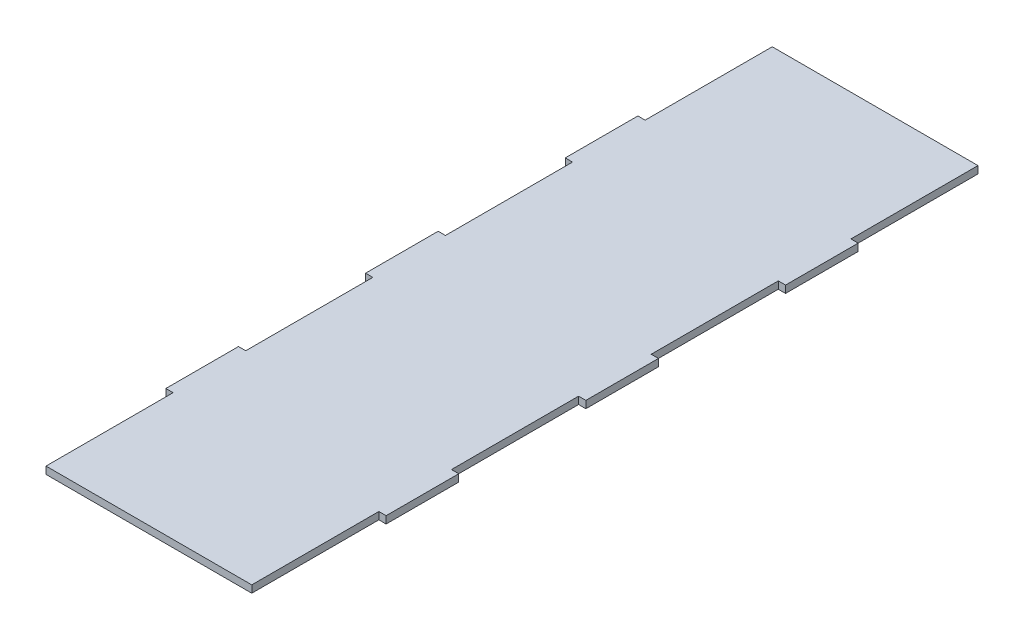
ISO-10303-21;
HEADER;
FILE_DESCRIPTION(('STEP AP214'),'2;1');
FILE_NAME('part.step','',(''),(''),'','','');
FILE_SCHEMA(('AUTOMOTIVE_DESIGN { 1 0 10303 214 1 1 1 1 }'));
ENDSEC;
DATA;
#1=APPLICATION_CONTEXT('core data for automotive mechanical design processes');
#2=APPLICATION_PROTOCOL_DEFINITION('international standard','automotive_design',2000,#1);
#3=PRODUCT_CONTEXT('',#1,'mechanical');
#4=PRODUCT('Part','Part','',(#3));
#5=PRODUCT_RELATED_PRODUCT_CATEGORY('part','',(#4));
#6=PRODUCT_DEFINITION_FORMATION('','',#4);
#7=PRODUCT_DEFINITION_CONTEXT('part definition',#1,'design');
#8=PRODUCT_DEFINITION('design','',#6,#7);
#9=PRODUCT_DEFINITION_SHAPE('','',#8);
#10=(LENGTH_UNIT() NAMED_UNIT(*) SI_UNIT(.MILLI.,.METRE.));
#11=(NAMED_UNIT(*) PLANE_ANGLE_UNIT() SI_UNIT($,.RADIAN.));
#12=(NAMED_UNIT(*) SI_UNIT($,.STERADIAN.) SOLID_ANGLE_UNIT());
#13=UNCERTAINTY_MEASURE_WITH_UNIT(LENGTH_MEASURE(1.E-05),#10,'distance_accuracy_value','');
#14=(GEOMETRIC_REPRESENTATION_CONTEXT(3) GLOBAL_UNCERTAINTY_ASSIGNED_CONTEXT((#13)) GLOBAL_UNIT_ASSIGNED_CONTEXT((#10,
#11,#12)) REPRESENTATION_CONTEXT('',''));
#15=CARTESIAN_POINT('',(0.,0.,0.));
#16=DIRECTION('',(0.,0.,1.));
#17=DIRECTION('',(1.,0.,0.));
#18=AXIS2_PLACEMENT_3D('',#15,#16,#17);
#19=CARTESIAN_POINT('',(-42.5,3.,-97.5));
#20=DIRECTION('',(1.,0.,0.));
#21=DIRECTION('',(0.,0.,-1.));
#22=AXIS2_PLACEMENT_3D('',#19,#20,#21);
#23=PLANE('',#22);
#24=DIRECTION('',(0.,0.,1.));
#25=VECTOR('',#24,1.);
#26=CARTESIAN_POINT('',(-42.5,0.,-97.5));
#27=LINE('',#26,#25);
#28=CARTESIAN_POINT('',(-42.5,0.,-150.));
#29=VERTEX_POINT('',#28);
#30=CARTESIAN_POINT('',(-42.5,0.,-97.5));
#31=VERTEX_POINT('',#30);
#32=EDGE_CURVE('E254',#29,#31,#27,.T.);
#33=ORIENTED_EDGE('',*,*,#32,.T.);
#34=DIRECTION('',(0.,-1.,0.));
#35=VECTOR('',#34,1.);
#36=CARTESIAN_POINT('',(-42.5,3.,-97.5));
#37=LINE('',#36,#35);
#38=CARTESIAN_POINT('',(-42.5,3.,-97.5));
#39=VERTEX_POINT('',#38);
#40=EDGE_CURVE('E11',#39,#31,#37,.T.);
#41=ORIENTED_EDGE('',*,*,#40,.F.);
#42=DIRECTION('',(0.,0.,1.));
#43=VECTOR('',#42,1.);
#44=CARTESIAN_POINT('',(-42.5,3.,-97.5));
#45=LINE('',#44,#43);
#46=CARTESIAN_POINT('',(-42.5,3.,-150.));
#47=VERTEX_POINT('',#46);
#48=EDGE_CURVE('E308',#47,#39,#45,.T.);
#49=ORIENTED_EDGE('',*,*,#48,.F.);
#50=DIRECTION('',(0.,-1.,0.));
#51=VECTOR('',#50,1.);
#52=CARTESIAN_POINT('',(-42.5,3.,-150.));
#53=LINE('',#52,#51);
#54=EDGE_CURVE('E250',#47,#29,#53,.T.);
#55=ORIENTED_EDGE('',*,*,#54,.T.);
#56=EDGE_LOOP('',(#33,#41,#49,#55));
#57=FACE_BOUND('',#56,.T.);
#58=ADVANCED_FACE('F38',(#57),#23,.F.);
#59=CARTESIAN_POINT('',(-45.5,3.,-97.5));
#60=DIRECTION('',(0.,0.,1.));
#61=DIRECTION('',(1.,0.,0.));
#62=AXIS2_PLACEMENT_3D('',#59,#60,#61);
#63=PLANE('',#62);
#64=DIRECTION('',(-1.,0.,0.));
#65=VECTOR('',#64,1.);
#66=CARTESIAN_POINT('',(-45.5,0.,-97.5));
#67=LINE('',#66,#65);
#68=CARTESIAN_POINT('',(-45.5,0.,-97.5));
#69=VERTEX_POINT('',#68);
#70=EDGE_CURVE('E257',#31,#69,#67,.T.);
#71=ORIENTED_EDGE('',*,*,#70,.T.);
#72=DIRECTION('',(0.,-1.,0.));
#73=VECTOR('',#72,1.);
#74=CARTESIAN_POINT('',(-45.5,3.,-97.5));
#75=LINE('',#74,#73);
#76=CARTESIAN_POINT('',(-45.5,3.,-97.5));
#77=VERTEX_POINT('',#76);
#78=EDGE_CURVE('E46',#77,#69,#75,.T.);
#79=ORIENTED_EDGE('',*,*,#78,.F.);
#80=DIRECTION('',(-1.,0.,0.));
#81=VECTOR('',#80,1.);
#82=CARTESIAN_POINT('',(-45.5,3.,-97.5));
#83=LINE('',#82,#81);
#84=EDGE_CURVE('E157',#39,#77,#83,.T.);
#85=ORIENTED_EDGE('',*,*,#84,.F.);
#86=ORIENTED_EDGE('',*,*,#40,.T.);
#87=EDGE_LOOP('',(#71,#79,#85,#86));
#88=FACE_BOUND('',#87,.T.);
#89=ADVANCED_FACE('F466',(#88),#63,.F.);
#90=CARTESIAN_POINT('',(-45.5,3.,-67.5));
#91=DIRECTION('',(1.,0.,0.));
#92=DIRECTION('',(0.,0.,-1.));
#93=AXIS2_PLACEMENT_3D('',#90,#91,#92);
#94=PLANE('',#93);
#95=DIRECTION('',(0.,0.,1.));
#96=VECTOR('',#95,1.);
#97=CARTESIAN_POINT('',(-45.5,0.,-67.5));
#98=LINE('',#97,#96);
#99=CARTESIAN_POINT('',(-45.5,0.,-67.5));
#100=VERTEX_POINT('',#99);
#101=EDGE_CURVE('E259',#69,#100,#98,.T.);
#102=ORIENTED_EDGE('',*,*,#101,.T.);
#103=DIRECTION('',(0.,-1.,0.));
#104=VECTOR('',#103,1.);
#105=CARTESIAN_POINT('',(-45.5,3.,-67.5));
#106=LINE('',#105,#104);
#107=CARTESIAN_POINT('',(-45.5,3.,-67.5));
#108=VERTEX_POINT('',#107);
#109=EDGE_CURVE('E375',#108,#100,#106,.T.);
#110=ORIENTED_EDGE('',*,*,#109,.F.);
#111=DIRECTION('',(0.,0.,1.));
#112=VECTOR('',#111,1.);
#113=CARTESIAN_POINT('',(-45.5,3.,-67.5));
#114=LINE('',#113,#112);
#115=EDGE_CURVE('E383',#77,#108,#114,.T.);
#116=ORIENTED_EDGE('',*,*,#115,.F.);
#117=ORIENTED_EDGE('',*,*,#78,.T.);
#118=EDGE_LOOP('',(#102,#110,#116,#117));
#119=FACE_BOUND('',#118,.T.);
#120=ADVANCED_FACE('F381',(#119),#94,.F.);
#121=CARTESIAN_POINT('',(-45.5,3.,-67.5));
#122=DIRECTION('',(0.,0.,-1.));
#123=DIRECTION('',(-1.,0.,0.));
#124=AXIS2_PLACEMENT_3D('',#121,#122,#123);
#125=PLANE('',#124);
#126=DIRECTION('',(1.,0.,0.));
#127=VECTOR('',#126,1.);
#128=CARTESIAN_POINT('',(-45.5,0.,-67.5));
#129=LINE('',#128,#127);
#130=CARTESIAN_POINT('',(-42.5,0.,-67.5));
#131=VERTEX_POINT('',#130);
#132=EDGE_CURVE('E261',#100,#131,#129,.T.);
#133=ORIENTED_EDGE('',*,*,#132,.T.);
#134=DIRECTION('',(0.,-1.,0.));
#135=VECTOR('',#134,1.);
#136=CARTESIAN_POINT('',(-42.5,3.,-67.5));
#137=LINE('',#136,#135);
#138=CARTESIAN_POINT('',(-42.5,3.,-67.5));
#139=VERTEX_POINT('',#138);
#140=EDGE_CURVE('E372',#139,#131,#137,.T.);
#141=ORIENTED_EDGE('',*,*,#140,.F.);
#142=DIRECTION('',(1.,0.,0.));
#143=VECTOR('',#142,1.);
#144=CARTESIAN_POINT('',(-45.5,3.,-67.5));
#145=LINE('',#144,#143);
#146=EDGE_CURVE('E401',#108,#139,#145,.T.);
#147=ORIENTED_EDGE('',*,*,#146,.F.);
#148=ORIENTED_EDGE('',*,*,#109,.T.);
#149=EDGE_LOOP('',(#133,#141,#147,#148));
#150=FACE_BOUND('',#149,.T.);
#151=ADVANCED_FACE('F392',(#150),#125,.F.);
#152=CARTESIAN_POINT('',(-42.5,3.,-15.));
#153=DIRECTION('',(1.,0.,0.));
#154=DIRECTION('',(0.,0.,-1.));
#155=AXIS2_PLACEMENT_3D('',#152,#153,#154);
#156=PLANE('',#155);
#157=DIRECTION('',(0.,0.,1.));
#158=VECTOR('',#157,1.);
#159=CARTESIAN_POINT('',(-42.5,0.,-15.));
#160=LINE('',#159,#158);
#161=CARTESIAN_POINT('',(-42.5,0.,-15.));
#162=VERTEX_POINT('',#161);
#163=EDGE_CURVE('E263',#131,#162,#160,.T.);
#164=ORIENTED_EDGE('',*,*,#163,.T.);
#165=DIRECTION('',(0.,-1.,0.));
#166=VECTOR('',#165,1.);
#167=CARTESIAN_POINT('',(-42.5,3.,-15.));
#168=LINE('',#167,#166);
#169=CARTESIAN_POINT('',(-42.5,3.,-15.));
#170=VERTEX_POINT('',#169);
#171=EDGE_CURVE('E369',#170,#162,#168,.T.);
#172=ORIENTED_EDGE('',*,*,#171,.F.);
#173=DIRECTION('',(0.,0.,1.));
#174=VECTOR('',#173,1.);
#175=CARTESIAN_POINT('',(-42.5,3.,-15.));
#176=LINE('',#175,#174);
#177=EDGE_CURVE('E398',#139,#170,#176,.T.);
#178=ORIENTED_EDGE('',*,*,#177,.F.);
#179=ORIENTED_EDGE('',*,*,#140,.T.);
#180=EDGE_LOOP('',(#164,#172,#178,#179));
#181=FACE_BOUND('',#180,.T.);
#182=ADVANCED_FACE('F396',(#181),#156,.F.);
#183=CARTESIAN_POINT('',(-45.5,3.,-15.));
#184=DIRECTION('',(0.,0.,1.));
#185=DIRECTION('',(1.,0.,0.));
#186=AXIS2_PLACEMENT_3D('',#183,#184,#185);
#187=PLANE('',#186);
#188=DIRECTION('',(-1.,0.,0.));
#189=VECTOR('',#188,1.);
#190=CARTESIAN_POINT('',(-45.5,0.,-15.));
#191=LINE('',#190,#189);
#192=CARTESIAN_POINT('',(-45.5,0.,-15.));
#193=VERTEX_POINT('',#192);
#194=EDGE_CURVE('E265',#162,#193,#191,.T.);
#195=ORIENTED_EDGE('',*,*,#194,.T.);
#196=DIRECTION('',(0.,-1.,0.));
#197=VECTOR('',#196,1.);
#198=CARTESIAN_POINT('',(-45.5,3.,-15.));
#199=LINE('',#198,#197);
#200=CARTESIAN_POINT('',(-45.5,3.,-15.));
#201=VERTEX_POINT('',#200);
#202=EDGE_CURVE('E366',#201,#193,#199,.T.);
#203=ORIENTED_EDGE('',*,*,#202,.F.);
#204=DIRECTION('',(-1.,0.,0.));
#205=VECTOR('',#204,1.);
#206=CARTESIAN_POINT('',(-45.5,3.,-15.));
#207=LINE('',#206,#205);
#208=EDGE_CURVE('E400',#170,#201,#207,.T.);
#209=ORIENTED_EDGE('',*,*,#208,.F.);
#210=ORIENTED_EDGE('',*,*,#171,.T.);
#211=EDGE_LOOP('',(#195,#203,#209,#210));
#212=FACE_BOUND('',#211,.T.);
#213=ADVANCED_FACE('F479',(#212),#187,.F.);
#214=CARTESIAN_POINT('',(-45.5,3.,15.));
#215=DIRECTION('',(1.,0.,0.));
#216=DIRECTION('',(0.,0.,-1.));
#217=AXIS2_PLACEMENT_3D('',#214,#215,#216);
#218=PLANE('',#217);
#219=DIRECTION('',(0.,0.,1.));
#220=VECTOR('',#219,1.);
#221=CARTESIAN_POINT('',(-45.5,0.,15.));
#222=LINE('',#221,#220);
#223=CARTESIAN_POINT('',(-45.5,0.,15.));
#224=VERTEX_POINT('',#223);
#225=EDGE_CURVE('E267',#193,#224,#222,.T.);
#226=ORIENTED_EDGE('',*,*,#225,.T.);
#227=DIRECTION('',(0.,-1.,0.));
#228=VECTOR('',#227,1.);
#229=CARTESIAN_POINT('',(-45.5,3.,15.));
#230=LINE('',#229,#228);
#231=CARTESIAN_POINT('',(-45.5,3.,15.));
#232=VERTEX_POINT('',#231);
#233=EDGE_CURVE('E363',#232,#224,#230,.T.);
#234=ORIENTED_EDGE('',*,*,#233,.F.);
#235=DIRECTION('',(0.,0.,1.));
#236=VECTOR('',#235,1.);
#237=CARTESIAN_POINT('',(-45.5,3.,15.));
#238=LINE('',#237,#236);
#239=EDGE_CURVE('E403',#201,#232,#238,.T.);
#240=ORIENTED_EDGE('',*,*,#239,.F.);
#241=ORIENTED_EDGE('',*,*,#202,.T.);
#242=EDGE_LOOP('',(#226,#234,#240,#241));
#243=FACE_BOUND('',#242,.T.);
#244=ADVANCED_FACE('F482',(#243),#218,.F.);
#245=CARTESIAN_POINT('',(-45.5,3.,15.));
#246=DIRECTION('',(0.,0.,-1.));
#247=DIRECTION('',(-1.,0.,0.));
#248=AXIS2_PLACEMENT_3D('',#245,#246,#247);
#249=PLANE('',#248);
#250=DIRECTION('',(1.,0.,0.));
#251=VECTOR('',#250,1.);
#252=CARTESIAN_POINT('',(-45.5,0.,15.));
#253=LINE('',#252,#251);
#254=CARTESIAN_POINT('',(-42.5,0.,15.));
#255=VERTEX_POINT('',#254);
#256=EDGE_CURVE('E269',#224,#255,#253,.T.);
#257=ORIENTED_EDGE('',*,*,#256,.T.);
#258=DIRECTION('',(0.,-1.,0.));
#259=VECTOR('',#258,1.);
#260=CARTESIAN_POINT('',(-42.5,3.,15.));
#261=LINE('',#260,#259);
#262=CARTESIAN_POINT('',(-42.5,3.,15.));
#263=VERTEX_POINT('',#262);
#264=EDGE_CURVE('E360',#263,#255,#261,.T.);
#265=ORIENTED_EDGE('',*,*,#264,.F.);
#266=DIRECTION('',(1.,0.,0.));
#267=VECTOR('',#266,1.);
#268=CARTESIAN_POINT('',(-45.5,3.,15.));
#269=LINE('',#268,#267);
#270=EDGE_CURVE('E409',#232,#263,#269,.T.);
#271=ORIENTED_EDGE('',*,*,#270,.F.);
#272=ORIENTED_EDGE('',*,*,#233,.T.);
#273=EDGE_LOOP('',(#257,#265,#271,#272));
#274=FACE_BOUND('',#273,.T.);
#275=ADVANCED_FACE('F486',(#274),#249,.F.);
#276=CARTESIAN_POINT('',(-42.5,3.,67.5));
#277=DIRECTION('',(1.,0.,0.));
#278=DIRECTION('',(0.,0.,-1.));
#279=AXIS2_PLACEMENT_3D('',#276,#277,#278);
#280=PLANE('',#279);
#281=DIRECTION('',(0.,0.,1.));
#282=VECTOR('',#281,1.);
#283=CARTESIAN_POINT('',(-42.5,0.,67.5));
#284=LINE('',#283,#282);
#285=CARTESIAN_POINT('',(-42.5,0.,67.5));
#286=VERTEX_POINT('',#285);
#287=EDGE_CURVE('E271',#255,#286,#284,.T.);
#288=ORIENTED_EDGE('',*,*,#287,.T.);
#289=DIRECTION('',(0.,-1.,0.));
#290=VECTOR('',#289,1.);
#291=CARTESIAN_POINT('',(-42.5,3.,67.5));
#292=LINE('',#291,#290);
#293=CARTESIAN_POINT('',(-42.5,3.,67.5));
#294=VERTEX_POINT('',#293);
#295=EDGE_CURVE('E357',#294,#286,#292,.T.);
#296=ORIENTED_EDGE('',*,*,#295,.F.);
#297=DIRECTION('',(0.,0.,1.));
#298=VECTOR('',#297,1.);
#299=CARTESIAN_POINT('',(-42.5,3.,67.5));
#300=LINE('',#299,#298);
#301=EDGE_CURVE('E411',#263,#294,#300,.T.);
#302=ORIENTED_EDGE('',*,*,#301,.F.);
#303=ORIENTED_EDGE('',*,*,#264,.T.);
#304=EDGE_LOOP('',(#288,#296,#302,#303));
#305=FACE_BOUND('',#304,.T.);
#306=ADVANCED_FACE('F490',(#305),#280,.F.);
#307=CARTESIAN_POINT('',(-45.5,3.,67.5));
#308=DIRECTION('',(0.,0.,1.));
#309=DIRECTION('',(1.,0.,0.));
#310=AXIS2_PLACEMENT_3D('',#307,#308,#309);
#311=PLANE('',#310);
#312=DIRECTION('',(-1.,0.,0.));
#313=VECTOR('',#312,1.);
#314=CARTESIAN_POINT('',(-45.5,0.,67.5));
#315=LINE('',#314,#313);
#316=CARTESIAN_POINT('',(-45.5,0.,67.5));
#317=VERTEX_POINT('',#316);
#318=EDGE_CURVE('E273',#286,#317,#315,.T.);
#319=ORIENTED_EDGE('',*,*,#318,.T.);
#320=DIRECTION('',(0.,-1.,0.));
#321=VECTOR('',#320,1.);
#322=CARTESIAN_POINT('',(-45.5,3.,67.5));
#323=LINE('',#322,#321);
#324=CARTESIAN_POINT('',(-45.5,3.,67.5));
#325=VERTEX_POINT('',#324);
#326=EDGE_CURVE('E354',#325,#317,#323,.T.);
#327=ORIENTED_EDGE('',*,*,#326,.F.);
#328=DIRECTION('',(-1.,0.,0.));
#329=VECTOR('',#328,1.);
#330=CARTESIAN_POINT('',(-45.5,3.,67.5));
#331=LINE('',#330,#329);
#332=EDGE_CURVE('E413',#294,#325,#331,.T.);
#333=ORIENTED_EDGE('',*,*,#332,.F.);
#334=ORIENTED_EDGE('',*,*,#295,.T.);
#335=EDGE_LOOP('',(#319,#327,#333,#334));
#336=FACE_BOUND('',#335,.T.);
#337=ADVANCED_FACE('F494',(#336),#311,.F.);
#338=CARTESIAN_POINT('',(-45.5,3.,97.5));
#339=DIRECTION('',(1.,0.,0.));
#340=DIRECTION('',(0.,0.,-1.));
#341=AXIS2_PLACEMENT_3D('',#338,#339,#340);
#342=PLANE('',#341);
#343=DIRECTION('',(0.,0.,1.));
#344=VECTOR('',#343,1.);
#345=CARTESIAN_POINT('',(-45.5,0.,97.5));
#346=LINE('',#345,#344);
#347=CARTESIAN_POINT('',(-45.5,0.,97.5));
#348=VERTEX_POINT('',#347);
#349=EDGE_CURVE('E275',#317,#348,#346,.T.);
#350=ORIENTED_EDGE('',*,*,#349,.T.);
#351=DIRECTION('',(0.,-1.,0.));
#352=VECTOR('',#351,1.);
#353=CARTESIAN_POINT('',(-45.5,3.,97.5));
#354=LINE('',#353,#352);
#355=CARTESIAN_POINT('',(-45.5,3.,97.5));
#356=VERTEX_POINT('',#355);
#357=EDGE_CURVE('E351',#356,#348,#354,.T.);
#358=ORIENTED_EDGE('',*,*,#357,.F.);
#359=DIRECTION('',(0.,0.,1.));
#360=VECTOR('',#359,1.);
#361=CARTESIAN_POINT('',(-45.5,3.,97.5));
#362=LINE('',#361,#360);
#363=EDGE_CURVE('E415',#325,#356,#362,.T.);
#364=ORIENTED_EDGE('',*,*,#363,.F.);
#365=ORIENTED_EDGE('',*,*,#326,.T.);
#366=EDGE_LOOP('',(#350,#358,#364,#365));
#367=FACE_BOUND('',#366,.T.);
#368=ADVANCED_FACE('F498',(#367),#342,.F.);
#369=CARTESIAN_POINT('',(-45.5,3.,97.5));
#370=DIRECTION('',(0.,0.,-1.));
#371=DIRECTION('',(-1.,0.,0.));
#372=AXIS2_PLACEMENT_3D('',#369,#370,#371);
#373=PLANE('',#372);
#374=DIRECTION('',(1.,0.,0.));
#375=VECTOR('',#374,1.);
#376=CARTESIAN_POINT('',(-45.5,0.,97.5));
#377=LINE('',#376,#375);
#378=CARTESIAN_POINT('',(-42.5,0.,97.5));
#379=VERTEX_POINT('',#378);
#380=EDGE_CURVE('E277',#348,#379,#377,.T.);
#381=ORIENTED_EDGE('',*,*,#380,.T.);
#382=DIRECTION('',(0.,-1.,0.));
#383=VECTOR('',#382,1.);
#384=CARTESIAN_POINT('',(-42.5,3.,97.5));
#385=LINE('',#384,#383);
#386=CARTESIAN_POINT('',(-42.5,3.,97.5));
#387=VERTEX_POINT('',#386);
#388=EDGE_CURVE('E348',#387,#379,#385,.T.);
#389=ORIENTED_EDGE('',*,*,#388,.F.);
#390=DIRECTION('',(1.,0.,0.));
#391=VECTOR('',#390,1.);
#392=CARTESIAN_POINT('',(-45.5,3.,97.5));
#393=LINE('',#392,#391);
#394=EDGE_CURVE('E417',#356,#387,#393,.T.);
#395=ORIENTED_EDGE('',*,*,#394,.F.);
#396=ORIENTED_EDGE('',*,*,#357,.T.);
#397=EDGE_LOOP('',(#381,#389,#395,#396));
#398=FACE_BOUND('',#397,.T.);
#399=ADVANCED_FACE('F502',(#398),#373,.F.);
#400=CARTESIAN_POINT('',(-42.5,3.,150.));
#401=DIRECTION('',(1.,0.,0.));
#402=DIRECTION('',(0.,0.,-1.));
#403=AXIS2_PLACEMENT_3D('',#400,#401,#402);
#404=PLANE('',#403);
#405=DIRECTION('',(0.,0.,1.));
#406=VECTOR('',#405,1.);
#407=CARTESIAN_POINT('',(-42.5,0.,150.));
#408=LINE('',#407,#406);
#409=CARTESIAN_POINT('',(-42.5,0.,150.));
#410=VERTEX_POINT('',#409);
#411=EDGE_CURVE('E279',#379,#410,#408,.T.);
#412=ORIENTED_EDGE('',*,*,#411,.T.);
#413=DIRECTION('',(0.,-1.,0.));
#414=VECTOR('',#413,1.);
#415=CARTESIAN_POINT('',(-42.5,3.,150.));
#416=LINE('',#415,#414);
#417=CARTESIAN_POINT('',(-42.5,3.,150.));
#418=VERTEX_POINT('',#417);
#419=EDGE_CURVE('E345',#418,#410,#416,.T.);
#420=ORIENTED_EDGE('',*,*,#419,.F.);
#421=DIRECTION('',(0.,0.,1.));
#422=VECTOR('',#421,1.);
#423=CARTESIAN_POINT('',(-42.5,3.,150.));
#424=LINE('',#423,#422);
#425=EDGE_CURVE('E419',#387,#418,#424,.T.);
#426=ORIENTED_EDGE('',*,*,#425,.F.);
#427=ORIENTED_EDGE('',*,*,#388,.T.);
#428=EDGE_LOOP('',(#412,#420,#426,#427));
#429=FACE_BOUND('',#428,.T.);
#430=ADVANCED_FACE('F506',(#429),#404,.F.);
#431=CARTESIAN_POINT('',(42.5,3.,150.));
#432=DIRECTION('',(0.,0.,-1.));
#433=DIRECTION('',(-1.,0.,0.));
#434=AXIS2_PLACEMENT_3D('',#431,#432,#433);
#435=PLANE('',#434);
#436=DIRECTION('',(1.,0.,0.));
#437=VECTOR('',#436,1.);
#438=CARTESIAN_POINT('',(42.5,0.,150.));
#439=LINE('',#438,#437);
#440=CARTESIAN_POINT('',(42.5,0.,150.));
#441=VERTEX_POINT('',#440);
#442=EDGE_CURVE('E281',#410,#441,#439,.T.);
#443=ORIENTED_EDGE('',*,*,#442,.T.);
#444=DIRECTION('',(0.,-1.,0.));
#445=VECTOR('',#444,1.);
#446=CARTESIAN_POINT('',(42.5,3.,150.));
#447=LINE('',#446,#445);
#448=CARTESIAN_POINT('',(42.5,3.,150.));
#449=VERTEX_POINT('',#448);
#450=EDGE_CURVE('E342',#449,#441,#447,.T.);
#451=ORIENTED_EDGE('',*,*,#450,.F.);
#452=DIRECTION('',(1.,0.,0.));
#453=VECTOR('',#452,1.);
#454=CARTESIAN_POINT('',(42.5,3.,150.));
#455=LINE('',#454,#453);
#456=EDGE_CURVE('E421',#418,#449,#455,.T.);
#457=ORIENTED_EDGE('',*,*,#456,.F.);
#458=ORIENTED_EDGE('',*,*,#419,.T.);
#459=EDGE_LOOP('',(#443,#451,#457,#458));
#460=FACE_BOUND('',#459,.T.);
#461=ADVANCED_FACE('F510',(#460),#435,.F.);
#462=CARTESIAN_POINT('',(42.5,3.,150.));
#463=DIRECTION('',(-1.,0.,0.));
#464=DIRECTION('',(0.,0.,1.));
#465=AXIS2_PLACEMENT_3D('',#462,#463,#464);
#466=PLANE('',#465);
#467=DIRECTION('',(0.,0.,-1.));
#468=VECTOR('',#467,1.);
#469=CARTESIAN_POINT('',(42.5,0.,150.));
#470=LINE('',#469,#468);
#471=CARTESIAN_POINT('',(42.5,0.,97.5));
#472=VERTEX_POINT('',#471);
#473=EDGE_CURVE('E283',#441,#472,#470,.T.);
#474=ORIENTED_EDGE('',*,*,#473,.T.);
#475=DIRECTION('',(0.,-1.,0.));
#476=VECTOR('',#475,1.);
#477=CARTESIAN_POINT('',(42.5,3.,97.5));
#478=LINE('',#477,#476);
#479=CARTESIAN_POINT('',(42.5,3.,97.5));
#480=VERTEX_POINT('',#479);
#481=EDGE_CURVE('E339',#480,#472,#478,.T.);
#482=ORIENTED_EDGE('',*,*,#481,.F.);
#483=DIRECTION('',(0.,0.,-1.));
#484=VECTOR('',#483,1.);
#485=CARTESIAN_POINT('',(42.5,3.,150.));
#486=LINE('',#485,#484);
#487=EDGE_CURVE('E423',#449,#480,#486,.T.);
#488=ORIENTED_EDGE('',*,*,#487,.F.);
#489=ORIENTED_EDGE('',*,*,#450,.T.);
#490=EDGE_LOOP('',(#474,#482,#488,#489));
#491=FACE_BOUND('',#490,.T.);
#492=ADVANCED_FACE('F514',(#491),#466,.F.);
#493=CARTESIAN_POINT('',(42.5,3.,97.5));
#494=DIRECTION('',(0.,0.,-1.));
#495=DIRECTION('',(-1.,0.,0.));
#496=AXIS2_PLACEMENT_3D('',#493,#494,#495);
#497=PLANE('',#496);
#498=DIRECTION('',(1.,0.,0.));
#499=VECTOR('',#498,1.);
#500=CARTESIAN_POINT('',(42.5,0.,97.5));
#501=LINE('',#500,#499);
#502=CARTESIAN_POINT('',(45.5,0.,97.5));
#503=VERTEX_POINT('',#502);
#504=EDGE_CURVE('E285',#472,#503,#501,.T.);
#505=ORIENTED_EDGE('',*,*,#504,.T.);
#506=DIRECTION('',(0.,-1.,0.));
#507=VECTOR('',#506,1.);
#508=CARTESIAN_POINT('',(45.5,3.,97.5));
#509=LINE('',#508,#507);
#510=CARTESIAN_POINT('',(45.5,3.,97.5));
#511=VERTEX_POINT('',#510);
#512=EDGE_CURVE('E336',#511,#503,#509,.T.);
#513=ORIENTED_EDGE('',*,*,#512,.F.);
#514=DIRECTION('',(1.,0.,0.));
#515=VECTOR('',#514,1.);
#516=CARTESIAN_POINT('',(42.5,3.,97.5));
#517=LINE('',#516,#515);
#518=EDGE_CURVE('E425',#480,#511,#517,.T.);
#519=ORIENTED_EDGE('',*,*,#518,.F.);
#520=ORIENTED_EDGE('',*,*,#481,.T.);
#521=EDGE_LOOP('',(#505,#513,#519,#520));
#522=FACE_BOUND('',#521,.T.);
#523=ADVANCED_FACE('F518',(#522),#497,.F.);
#524=CARTESIAN_POINT('',(45.5,3.,97.5));
#525=DIRECTION('',(-1.,0.,0.));
#526=DIRECTION('',(0.,0.,1.));
#527=AXIS2_PLACEMENT_3D('',#524,#525,#526);
#528=PLANE('',#527);
#529=DIRECTION('',(0.,0.,-1.));
#530=VECTOR('',#529,1.);
#531=CARTESIAN_POINT('',(45.5,0.,97.5));
#532=LINE('',#531,#530);
#533=CARTESIAN_POINT('',(45.5,0.,67.5));
#534=VERTEX_POINT('',#533);
#535=EDGE_CURVE('E287',#503,#534,#532,.T.);
#536=ORIENTED_EDGE('',*,*,#535,.T.);
#537=DIRECTION('',(0.,-1.,0.));
#538=VECTOR('',#537,1.);
#539=CARTESIAN_POINT('',(45.5,3.,67.5));
#540=LINE('',#539,#538);
#541=CARTESIAN_POINT('',(45.5,3.,67.5));
#542=VERTEX_POINT('',#541);
#543=EDGE_CURVE('E333',#542,#534,#540,.T.);
#544=ORIENTED_EDGE('',*,*,#543,.F.);
#545=DIRECTION('',(0.,0.,-1.));
#546=VECTOR('',#545,1.);
#547=CARTESIAN_POINT('',(45.5,3.,97.5));
#548=LINE('',#547,#546);
#549=EDGE_CURVE('E427',#511,#542,#548,.T.);
#550=ORIENTED_EDGE('',*,*,#549,.F.);
#551=ORIENTED_EDGE('',*,*,#512,.T.);
#552=EDGE_LOOP('',(#536,#544,#550,#551));
#553=FACE_BOUND('',#552,.T.);
#554=ADVANCED_FACE('F522',(#553),#528,.F.);
#555=CARTESIAN_POINT('',(42.5,3.,67.5));
#556=DIRECTION('',(0.,0.,1.));
#557=DIRECTION('',(1.,0.,0.));
#558=AXIS2_PLACEMENT_3D('',#555,#556,#557);
#559=PLANE('',#558);
#560=DIRECTION('',(-1.,0.,0.));
#561=VECTOR('',#560,1.);
#562=CARTESIAN_POINT('',(42.5,0.,67.5));
#563=LINE('',#562,#561);
#564=CARTESIAN_POINT('',(42.5,0.,67.5));
#565=VERTEX_POINT('',#564);
#566=EDGE_CURVE('E289',#534,#565,#563,.T.);
#567=ORIENTED_EDGE('',*,*,#566,.T.);
#568=DIRECTION('',(0.,-1.,0.));
#569=VECTOR('',#568,1.);
#570=CARTESIAN_POINT('',(42.5,3.,67.5));
#571=LINE('',#570,#569);
#572=CARTESIAN_POINT('',(42.5,3.,67.5));
#573=VERTEX_POINT('',#572);
#574=EDGE_CURVE('E330',#573,#565,#571,.T.);
#575=ORIENTED_EDGE('',*,*,#574,.F.);
#576=DIRECTION('',(-1.,0.,0.));
#577=VECTOR('',#576,1.);
#578=CARTESIAN_POINT('',(42.5,3.,67.5));
#579=LINE('',#578,#577);
#580=EDGE_CURVE('E429',#542,#573,#579,.T.);
#581=ORIENTED_EDGE('',*,*,#580,.F.);
#582=ORIENTED_EDGE('',*,*,#543,.T.);
#583=EDGE_LOOP('',(#567,#575,#581,#582));
#584=FACE_BOUND('',#583,.T.);
#585=ADVANCED_FACE('F526',(#584),#559,.F.);
#586=CARTESIAN_POINT('',(42.5,3.,67.5));
#587=DIRECTION('',(-1.,0.,0.));
#588=DIRECTION('',(0.,0.,1.));
#589=AXIS2_PLACEMENT_3D('',#586,#587,#588);
#590=PLANE('',#589);
#591=DIRECTION('',(0.,0.,-1.));
#592=VECTOR('',#591,1.);
#593=CARTESIAN_POINT('',(42.5,0.,67.5));
#594=LINE('',#593,#592);
#595=CARTESIAN_POINT('',(42.5,0.,15.));
#596=VERTEX_POINT('',#595);
#597=EDGE_CURVE('E291',#565,#596,#594,.T.);
#598=ORIENTED_EDGE('',*,*,#597,.T.);
#599=DIRECTION('',(0.,-1.,0.));
#600=VECTOR('',#599,1.);
#601=CARTESIAN_POINT('',(42.5,3.,15.));
#602=LINE('',#601,#600);
#603=CARTESIAN_POINT('',(42.5,3.,15.));
#604=VERTEX_POINT('',#603);
#605=EDGE_CURVE('E327',#604,#596,#602,.T.);
#606=ORIENTED_EDGE('',*,*,#605,.F.);
#607=DIRECTION('',(0.,0.,-1.));
#608=VECTOR('',#607,1.);
#609=CARTESIAN_POINT('',(42.5,3.,67.5));
#610=LINE('',#609,#608);
#611=EDGE_CURVE('E431',#573,#604,#610,.T.);
#612=ORIENTED_EDGE('',*,*,#611,.F.);
#613=ORIENTED_EDGE('',*,*,#574,.T.);
#614=EDGE_LOOP('',(#598,#606,#612,#613));
#615=FACE_BOUND('',#614,.T.);
#616=ADVANCED_FACE('F530',(#615),#590,.F.);
#617=CARTESIAN_POINT('',(42.5,3.,15.));
#618=DIRECTION('',(0.,0.,-1.));
#619=DIRECTION('',(-1.,0.,0.));
#620=AXIS2_PLACEMENT_3D('',#617,#618,#619);
#621=PLANE('',#620);
#622=DIRECTION('',(1.,0.,0.));
#623=VECTOR('',#622,1.);
#624=CARTESIAN_POINT('',(42.5,0.,15.));
#625=LINE('',#624,#623);
#626=CARTESIAN_POINT('',(45.5,0.,15.));
#627=VERTEX_POINT('',#626);
#628=EDGE_CURVE('E293',#596,#627,#625,.T.);
#629=ORIENTED_EDGE('',*,*,#628,.T.);
#630=DIRECTION('',(0.,-1.,0.));
#631=VECTOR('',#630,1.);
#632=CARTESIAN_POINT('',(45.5,3.,15.));
#633=LINE('',#632,#631);
#634=CARTESIAN_POINT('',(45.5,3.,15.));
#635=VERTEX_POINT('',#634);
#636=EDGE_CURVE('E324',#635,#627,#633,.T.);
#637=ORIENTED_EDGE('',*,*,#636,.F.);
#638=DIRECTION('',(1.,0.,0.));
#639=VECTOR('',#638,1.);
#640=CARTESIAN_POINT('',(42.5,3.,15.));
#641=LINE('',#640,#639);
#642=EDGE_CURVE('E433',#604,#635,#641,.T.);
#643=ORIENTED_EDGE('',*,*,#642,.F.);
#644=ORIENTED_EDGE('',*,*,#605,.T.);
#645=EDGE_LOOP('',(#629,#637,#643,#644));
#646=FACE_BOUND('',#645,.T.);
#647=ADVANCED_FACE('F534',(#646),#621,.F.);
#648=CARTESIAN_POINT('',(45.5,3.,15.));
#649=DIRECTION('',(-1.,0.,0.));
#650=DIRECTION('',(0.,0.,1.));
#651=AXIS2_PLACEMENT_3D('',#648,#649,#650);
#652=PLANE('',#651);
#653=DIRECTION('',(0.,0.,-1.));
#654=VECTOR('',#653,1.);
#655=CARTESIAN_POINT('',(45.5,0.,15.));
#656=LINE('',#655,#654);
#657=CARTESIAN_POINT('',(45.5,0.,-15.));
#658=VERTEX_POINT('',#657);
#659=EDGE_CURVE('E295',#627,#658,#656,.T.);
#660=ORIENTED_EDGE('',*,*,#659,.T.);
#661=DIRECTION('',(0.,-1.,0.));
#662=VECTOR('',#661,1.);
#663=CARTESIAN_POINT('',(45.5,3.,-15.));
#664=LINE('',#663,#662);
#665=CARTESIAN_POINT('',(45.5,3.,-15.));
#666=VERTEX_POINT('',#665);
#667=EDGE_CURVE('E321',#666,#658,#664,.T.);
#668=ORIENTED_EDGE('',*,*,#667,.F.);
#669=DIRECTION('',(0.,0.,-1.));
#670=VECTOR('',#669,1.);
#671=CARTESIAN_POINT('',(45.5,3.,15.));
#672=LINE('',#671,#670);
#673=EDGE_CURVE('E435',#635,#666,#672,.T.);
#674=ORIENTED_EDGE('',*,*,#673,.F.);
#675=ORIENTED_EDGE('',*,*,#636,.T.);
#676=EDGE_LOOP('',(#660,#668,#674,#675));
#677=FACE_BOUND('',#676,.T.);
#678=ADVANCED_FACE('F538',(#677),#652,.F.);
#679=CARTESIAN_POINT('',(42.5,3.,-15.));
#680=DIRECTION('',(0.,0.,1.));
#681=DIRECTION('',(1.,0.,0.));
#682=AXIS2_PLACEMENT_3D('',#679,#680,#681);
#683=PLANE('',#682);
#684=DIRECTION('',(-1.,0.,0.));
#685=VECTOR('',#684,1.);
#686=CARTESIAN_POINT('',(42.5,0.,-15.));
#687=LINE('',#686,#685);
#688=CARTESIAN_POINT('',(42.5,0.,-15.));
#689=VERTEX_POINT('',#688);
#690=EDGE_CURVE('E297',#658,#689,#687,.T.);
#691=ORIENTED_EDGE('',*,*,#690,.T.);
#692=DIRECTION('',(0.,-1.,0.));
#693=VECTOR('',#692,1.);
#694=CARTESIAN_POINT('',(42.5,3.,-15.));
#695=LINE('',#694,#693);
#696=CARTESIAN_POINT('',(42.5,3.,-15.));
#697=VERTEX_POINT('',#696);
#698=EDGE_CURVE('E318',#697,#689,#695,.T.);
#699=ORIENTED_EDGE('',*,*,#698,.F.);
#700=DIRECTION('',(-1.,0.,0.));
#701=VECTOR('',#700,1.);
#702=CARTESIAN_POINT('',(42.5,3.,-15.));
#703=LINE('',#702,#701);
#704=EDGE_CURVE('E437',#666,#697,#703,.T.);
#705=ORIENTED_EDGE('',*,*,#704,.F.);
#706=ORIENTED_EDGE('',*,*,#667,.T.);
#707=EDGE_LOOP('',(#691,#699,#705,#706));
#708=FACE_BOUND('',#707,.T.);
#709=ADVANCED_FACE('F542',(#708),#683,.F.);
#710=CARTESIAN_POINT('',(42.5,3.,-15.));
#711=DIRECTION('',(-1.,0.,0.));
#712=DIRECTION('',(0.,0.,1.));
#713=AXIS2_PLACEMENT_3D('',#710,#711,#712);
#714=PLANE('',#713);
#715=DIRECTION('',(0.,0.,-1.));
#716=VECTOR('',#715,1.);
#717=CARTESIAN_POINT('',(42.5,0.,-15.));
#718=LINE('',#717,#716);
#719=CARTESIAN_POINT('',(42.5,0.,-67.5));
#720=VERTEX_POINT('',#719);
#721=EDGE_CURVE('E299',#689,#720,#718,.T.);
#722=ORIENTED_EDGE('',*,*,#721,.T.);
#723=DIRECTION('',(0.,-1.,0.));
#724=VECTOR('',#723,1.);
#725=CARTESIAN_POINT('',(42.5,3.,-67.5));
#726=LINE('',#725,#724);
#727=CARTESIAN_POINT('',(42.5,3.,-67.5));
#728=VERTEX_POINT('',#727);
#729=EDGE_CURVE('E315',#728,#720,#726,.T.);
#730=ORIENTED_EDGE('',*,*,#729,.F.);
#731=DIRECTION('',(0.,0.,-1.));
#732=VECTOR('',#731,1.);
#733=CARTESIAN_POINT('',(42.5,3.,-15.));
#734=LINE('',#733,#732);
#735=EDGE_CURVE('E439',#697,#728,#734,.T.);
#736=ORIENTED_EDGE('',*,*,#735,.F.);
#737=ORIENTED_EDGE('',*,*,#698,.T.);
#738=EDGE_LOOP('',(#722,#730,#736,#737));
#739=FACE_BOUND('',#738,.T.);
#740=ADVANCED_FACE('F546',(#739),#714,.F.);
#741=CARTESIAN_POINT('',(42.5,3.,-67.5));
#742=DIRECTION('',(0.,0.,-1.));
#743=DIRECTION('',(-1.,0.,0.));
#744=AXIS2_PLACEMENT_3D('',#741,#742,#743);
#745=PLANE('',#744);
#746=DIRECTION('',(1.,0.,0.));
#747=VECTOR('',#746,1.);
#748=CARTESIAN_POINT('',(42.5,0.,-67.5));
#749=LINE('',#748,#747);
#750=CARTESIAN_POINT('',(45.5,0.,-67.5));
#751=VERTEX_POINT('',#750);
#752=EDGE_CURVE('E301',#720,#751,#749,.T.);
#753=ORIENTED_EDGE('',*,*,#752,.T.);
#754=DIRECTION('',(0.,-1.,0.));
#755=VECTOR('',#754,1.);
#756=CARTESIAN_POINT('',(45.5,3.,-67.5));
#757=LINE('',#756,#755);
#758=CARTESIAN_POINT('',(45.5,3.,-67.5));
#759=VERTEX_POINT('',#758);
#760=EDGE_CURVE('E312',#759,#751,#757,.T.);
#761=ORIENTED_EDGE('',*,*,#760,.F.);
#762=DIRECTION('',(1.,0.,0.));
#763=VECTOR('',#762,1.);
#764=CARTESIAN_POINT('',(42.5,3.,-67.5));
#765=LINE('',#764,#763);
#766=EDGE_CURVE('E441',#728,#759,#765,.T.);
#767=ORIENTED_EDGE('',*,*,#766,.F.);
#768=ORIENTED_EDGE('',*,*,#729,.T.);
#769=EDGE_LOOP('',(#753,#761,#767,#768));
#770=FACE_BOUND('',#769,.T.);
#771=ADVANCED_FACE('F447',(#770),#745,.F.);
#772=CARTESIAN_POINT('',(45.5,3.,-67.5));
#773=DIRECTION('',(-1.,0.,0.));
#774=DIRECTION('',(0.,0.,1.));
#775=AXIS2_PLACEMENT_3D('',#772,#773,#774);
#776=PLANE('',#775);
#777=DIRECTION('',(0.,0.,-1.));
#778=VECTOR('',#777,1.);
#779=CARTESIAN_POINT('',(45.5,0.,-67.5));
#780=LINE('',#779,#778);
#781=CARTESIAN_POINT('',(45.5,0.,-97.5));
#782=VERTEX_POINT('',#781);
#783=EDGE_CURVE('E303',#751,#782,#780,.T.);
#784=ORIENTED_EDGE('',*,*,#783,.T.);
#785=DIRECTION('',(0.,-1.,0.));
#786=VECTOR('',#785,1.);
#787=CARTESIAN_POINT('',(45.5,3.,-97.5));
#788=LINE('',#787,#786);
#789=CARTESIAN_POINT('',(45.5,3.,-97.5));
#790=VERTEX_POINT('',#789);
#791=EDGE_CURVE('E245',#790,#782,#788,.T.);
#792=ORIENTED_EDGE('',*,*,#791,.F.);
#793=DIRECTION('',(0.,0.,-1.));
#794=VECTOR('',#793,1.);
#795=CARTESIAN_POINT('',(45.5,3.,-67.5));
#796=LINE('',#795,#794);
#797=EDGE_CURVE('E236',#759,#790,#796,.T.);
#798=ORIENTED_EDGE('',*,*,#797,.F.);
#799=ORIENTED_EDGE('',*,*,#760,.T.);
#800=EDGE_LOOP('',(#784,#792,#798,#799));
#801=FACE_BOUND('',#800,.T.);
#802=ADVANCED_FACE('F451',(#801),#776,.F.);
#803=CARTESIAN_POINT('',(42.5,3.,-97.5));
#804=DIRECTION('',(0.,0.,1.));
#805=DIRECTION('',(1.,0.,0.));
#806=AXIS2_PLACEMENT_3D('',#803,#804,#805);
#807=PLANE('',#806);
#808=DIRECTION('',(-1.,0.,0.));
#809=VECTOR('',#808,1.);
#810=CARTESIAN_POINT('',(42.5,0.,-97.5));
#811=LINE('',#810,#809);
#812=CARTESIAN_POINT('',(42.5,0.,-97.5));
#813=VERTEX_POINT('',#812);
#814=EDGE_CURVE('E244',#782,#813,#811,.T.);
#815=ORIENTED_EDGE('',*,*,#814,.T.);
#816=DIRECTION('',(0.,-1.,0.));
#817=VECTOR('',#816,1.);
#818=CARTESIAN_POINT('',(42.5,3.,-97.5));
#819=LINE('',#818,#817);
#820=CARTESIAN_POINT('',(42.5,3.,-97.5));
#821=VERTEX_POINT('',#820);
#822=EDGE_CURVE('E241',#821,#813,#819,.T.);
#823=ORIENTED_EDGE('',*,*,#822,.F.);
#824=DIRECTION('',(-1.,0.,0.));
#825=VECTOR('',#824,1.);
#826=CARTESIAN_POINT('',(42.5,3.,-97.5));
#827=LINE('',#826,#825);
#828=EDGE_CURVE('E230',#790,#821,#827,.T.);
#829=ORIENTED_EDGE('',*,*,#828,.F.);
#830=ORIENTED_EDGE('',*,*,#791,.T.);
#831=EDGE_LOOP('',(#815,#823,#829,#830));
#832=FACE_BOUND('',#831,.T.);
#833=ADVANCED_FACE('F242',(#832),#807,.F.);
#834=CARTESIAN_POINT('',(42.5,3.,-97.5));
#835=DIRECTION('',(-1.,0.,0.));
#836=DIRECTION('',(0.,0.,1.));
#837=AXIS2_PLACEMENT_3D('',#834,#835,#836);
#838=PLANE('',#837);
#839=DIRECTION('',(0.,0.,-1.));
#840=VECTOR('',#839,1.);
#841=CARTESIAN_POINT('',(42.5,0.,-97.5));
#842=LINE('',#841,#840);
#843=CARTESIAN_POINT('',(42.5,0.,-150.));
#844=VERTEX_POINT('',#843);
#845=EDGE_CURVE('E143',#813,#844,#842,.T.);
#846=ORIENTED_EDGE('',*,*,#845,.T.);
#847=DIRECTION('',(0.,-1.,0.));
#848=VECTOR('',#847,1.);
#849=CARTESIAN_POINT('',(42.5,3.,-150.));
#850=LINE('',#849,#848);
#851=CARTESIAN_POINT('',(42.5,3.,-150.));
#852=VERTEX_POINT('',#851);
#853=EDGE_CURVE('E246',#852,#844,#850,.T.);
#854=ORIENTED_EDGE('',*,*,#853,.F.);
#855=DIRECTION('',(0.,0.,-1.));
#856=VECTOR('',#855,1.);
#857=CARTESIAN_POINT('',(42.5,3.,-97.5));
#858=LINE('',#857,#856);
#859=EDGE_CURVE('E234',#821,#852,#858,.T.);
#860=ORIENTED_EDGE('',*,*,#859,.F.);
#861=ORIENTED_EDGE('',*,*,#822,.T.);
#862=EDGE_LOOP('',(#846,#854,#860,#861));
#863=FACE_BOUND('',#862,.T.);
#864=ADVANCED_FACE('F248',(#863),#838,.F.);
#865=CARTESIAN_POINT('',(42.5,3.,-150.));
#866=DIRECTION('',(0.,0.,1.));
#867=DIRECTION('',(1.,0.,0.));
#868=AXIS2_PLACEMENT_3D('',#865,#866,#867);
#869=PLANE('',#868);
#870=DIRECTION('',(-1.,0.,0.));
#871=VECTOR('',#870,1.);
#872=CARTESIAN_POINT('',(42.5,0.,-150.));
#873=LINE('',#872,#871);
#874=EDGE_CURVE('E149',#844,#29,#873,.T.);
#875=ORIENTED_EDGE('',*,*,#874,.T.);
#876=ORIENTED_EDGE('',*,*,#54,.F.);
#877=DIRECTION('',(-1.,0.,0.));
#878=VECTOR('',#877,1.);
#879=CARTESIAN_POINT('',(42.5,3.,-150.));
#880=LINE('',#879,#878);
#881=EDGE_CURVE('E54',#852,#47,#880,.T.);
#882=ORIENTED_EDGE('',*,*,#881,.F.);
#883=ORIENTED_EDGE('',*,*,#853,.T.);
#884=EDGE_LOOP('',(#875,#876,#882,#883));
#885=FACE_BOUND('',#884,.T.);
#886=ADVANCED_FACE('F455',(#885),#869,.F.);
#887=CARTESIAN_POINT('',(0.,3.,0.));
#888=DIRECTION('',(0.,1.,0.));
#889=DIRECTION('',(0.,0.,1.));
#890=AXIS2_PLACEMENT_3D('',#887,#888,#889);
#891=PLANE('',#890);
#892=ORIENTED_EDGE('',*,*,#48,.T.);
#893=ORIENTED_EDGE('',*,*,#84,.T.);
#894=ORIENTED_EDGE('',*,*,#115,.T.);
#895=ORIENTED_EDGE('',*,*,#146,.T.);
#896=ORIENTED_EDGE('',*,*,#177,.T.);
#897=ORIENTED_EDGE('',*,*,#208,.T.);
#898=ORIENTED_EDGE('',*,*,#239,.T.);
#899=ORIENTED_EDGE('',*,*,#270,.T.);
#900=ORIENTED_EDGE('',*,*,#301,.T.);
#901=ORIENTED_EDGE('',*,*,#332,.T.);
#902=ORIENTED_EDGE('',*,*,#363,.T.);
#903=ORIENTED_EDGE('',*,*,#394,.T.);
#904=ORIENTED_EDGE('',*,*,#425,.T.);
#905=ORIENTED_EDGE('',*,*,#456,.T.);
#906=ORIENTED_EDGE('',*,*,#487,.T.);
#907=ORIENTED_EDGE('',*,*,#518,.T.);
#908=ORIENTED_EDGE('',*,*,#549,.T.);
#909=ORIENTED_EDGE('',*,*,#580,.T.);
#910=ORIENTED_EDGE('',*,*,#611,.T.);
#911=ORIENTED_EDGE('',*,*,#642,.T.);
#912=ORIENTED_EDGE('',*,*,#673,.T.);
#913=ORIENTED_EDGE('',*,*,#704,.T.);
#914=ORIENTED_EDGE('',*,*,#735,.T.);
#915=ORIENTED_EDGE('',*,*,#766,.T.);
#916=ORIENTED_EDGE('',*,*,#797,.T.);
#917=ORIENTED_EDGE('',*,*,#828,.T.);
#918=ORIENTED_EDGE('',*,*,#859,.T.);
#919=ORIENTED_EDGE('',*,*,#881,.T.);
#920=EDGE_LOOP('',(#892,#893,#894,#895,#896,#897,#898,#899,#900,#901,#902,#903,#904,#905,#906,
#907,#908,#909,#910,#911,#912,#913,#914,#915,#916,#917,#918,#919));
#921=FACE_BOUND('',#920,.T.);
#922=ADVANCED_FACE('F232',(#921),#891,.T.);
#923=CARTESIAN_POINT('',(0.,0.,0.));
#924=DIRECTION('',(0.,1.,0.));
#925=DIRECTION('',(0.,0.,1.));
#926=AXIS2_PLACEMENT_3D('',#923,#924,#925);
#927=PLANE('',#926);
#928=ORIENTED_EDGE('',*,*,#32,.F.);
#929=ORIENTED_EDGE('',*,*,#874,.F.);
#930=ORIENTED_EDGE('',*,*,#845,.F.);
#931=ORIENTED_EDGE('',*,*,#814,.F.);
#932=ORIENTED_EDGE('',*,*,#783,.F.);
#933=ORIENTED_EDGE('',*,*,#752,.F.);
#934=ORIENTED_EDGE('',*,*,#721,.F.);
#935=ORIENTED_EDGE('',*,*,#690,.F.);
#936=ORIENTED_EDGE('',*,*,#659,.F.);
#937=ORIENTED_EDGE('',*,*,#628,.F.);
#938=ORIENTED_EDGE('',*,*,#597,.F.);
#939=ORIENTED_EDGE('',*,*,#566,.F.);
#940=ORIENTED_EDGE('',*,*,#535,.F.);
#941=ORIENTED_EDGE('',*,*,#504,.F.);
#942=ORIENTED_EDGE('',*,*,#473,.F.);
#943=ORIENTED_EDGE('',*,*,#442,.F.);
#944=ORIENTED_EDGE('',*,*,#411,.F.);
#945=ORIENTED_EDGE('',*,*,#380,.F.);
#946=ORIENTED_EDGE('',*,*,#349,.F.);
#947=ORIENTED_EDGE('',*,*,#318,.F.);
#948=ORIENTED_EDGE('',*,*,#287,.F.);
#949=ORIENTED_EDGE('',*,*,#256,.F.);
#950=ORIENTED_EDGE('',*,*,#225,.F.);
#951=ORIENTED_EDGE('',*,*,#194,.F.);
#952=ORIENTED_EDGE('',*,*,#163,.F.);
#953=ORIENTED_EDGE('',*,*,#132,.F.);
#954=ORIENTED_EDGE('',*,*,#101,.F.);
#955=ORIENTED_EDGE('',*,*,#70,.F.);
#956=EDGE_LOOP('',(#928,#929,#930,#931,#932,#933,#934,#935,#936,#937,#938,#939,#940,#941,#942,
#943,#944,#945,#946,#947,#948,#949,#950,#951,#952,#953,#954,#955));
#957=FACE_BOUND('',#956,.T.);
#958=ADVANCED_FACE('F387',(#957),#927,.F.);
#959=CLOSED_SHELL('',(#58,#89,#120,#151,#182,#213,#244,#275,#306,#337,#368,#399,#430,#461,#492,
#523,#554,#585,#616,#647,#678,#709,#740,#771,#802,#833,#864,#886,#922,#958));
#960=MANIFOLD_SOLID_BREP('B2',#959);
#961=ADVANCED_BREP_SHAPE_REPRESENTATION('',(#18,#960),#14);
#962=SHAPE_DEFINITION_REPRESENTATION(#9,#961);
ENDSEC;
END-ISO-10303-21;
